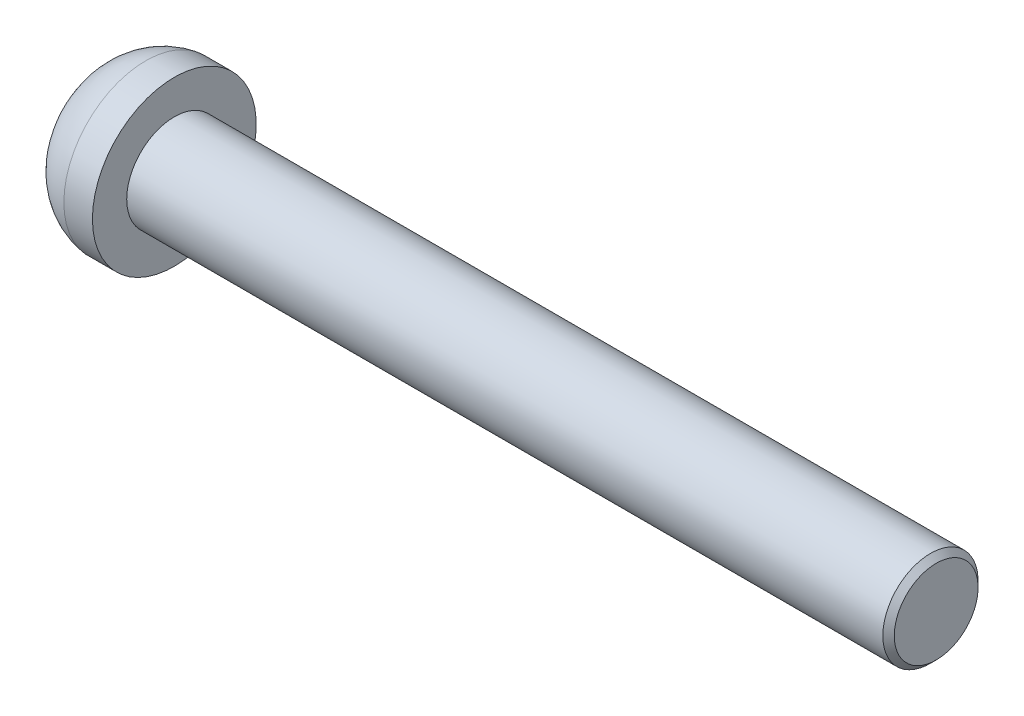
ISO-10303-21;
HEADER;
FILE_DESCRIPTION(('STEP AP214'),'2;1');
FILE_NAME('part.step','',(''),(''),'','','');
FILE_SCHEMA(('AUTOMOTIVE_DESIGN { 1 0 10303 214 1 1 1 1 }'));
ENDSEC;
DATA;
#1=APPLICATION_CONTEXT('core data for automotive mechanical design processes');
#2=APPLICATION_PROTOCOL_DEFINITION('international standard','automotive_design',2000,#1);
#3=PRODUCT_CONTEXT('',#1,'mechanical');
#4=PRODUCT('Part','Part','',(#3));
#5=PRODUCT_RELATED_PRODUCT_CATEGORY('part','',(#4));
#6=PRODUCT_DEFINITION_FORMATION('','',#4);
#7=PRODUCT_DEFINITION_CONTEXT('part definition',#1,'design');
#8=PRODUCT_DEFINITION('design','',#6,#7);
#9=PRODUCT_DEFINITION_SHAPE('','',#8);
#10=(LENGTH_UNIT() NAMED_UNIT(*) SI_UNIT(.MILLI.,.METRE.));
#11=(NAMED_UNIT(*) PLANE_ANGLE_UNIT() SI_UNIT($,.RADIAN.));
#12=(NAMED_UNIT(*) SI_UNIT($,.STERADIAN.) SOLID_ANGLE_UNIT());
#13=UNCERTAINTY_MEASURE_WITH_UNIT(LENGTH_MEASURE(1.E-05),#10,'distance_accuracy_value','');
#14=(GEOMETRIC_REPRESENTATION_CONTEXT(3) GLOBAL_UNCERTAINTY_ASSIGNED_CONTEXT((#13)) GLOBAL_UNIT_ASSIGNED_CONTEXT((#10,
#11,#12)) REPRESENTATION_CONTEXT('',''));
#15=CARTESIAN_POINT('',(0.,0.,0.));
#16=DIRECTION('',(0.,0.,1.));
#17=DIRECTION('',(1.,0.,0.));
#18=AXIS2_PLACEMENT_3D('',#15,#16,#17);
#19=CARTESIAN_POINT('',(0.,0.,0.));
#20=DIRECTION('',(1.,0.,0.));
#21=DIRECTION('',(0.,0.,-1.));
#22=AXIS2_PLACEMENT_3D('',#19,#20,#21);
#23=PLANE('',#22);
#24=DIRECTION('',(0.,-0.5,-0.866025403784439));
#25=VECTOR('',#24,1.);
#26=CARTESIAN_POINT('',(0.,2.3094010767585,0.));
#27=LINE('',#26,#25);
#28=CARTESIAN_POINT('',(0.,2.3094010767585,0.));
#29=VERTEX_POINT('',#28);
#30=CARTESIAN_POINT('',(0.,1.15470053837925,-2.));
#31=VERTEX_POINT('',#30);
#32=EDGE_CURVE('E140',#29,#31,#27,.T.);
#33=ORIENTED_EDGE('',*,*,#32,.F.);
#34=DIRECTION('',(0.,0.5,-0.866025403784439));
#35=VECTOR('',#34,1.);
#36=CARTESIAN_POINT('',(0.,1.15470053837925,2.));
#37=LINE('',#36,#35);
#38=CARTESIAN_POINT('',(0.,1.15470053837925,2.));
#39=VERTEX_POINT('',#38);
#40=EDGE_CURVE('E60',#39,#29,#37,.T.);
#41=ORIENTED_EDGE('',*,*,#40,.F.);
#42=DIRECTION('',(0.,1.,0.));
#43=VECTOR('',#42,1.);
#44=CARTESIAN_POINT('',(0.,-1.15470053837925,2.));
#45=LINE('',#44,#43);
#46=CARTESIAN_POINT('',(0.,-1.15470053837925,2.));
#47=VERTEX_POINT('',#46);
#48=EDGE_CURVE('E153',#47,#39,#45,.T.);
#49=ORIENTED_EDGE('',*,*,#48,.F.);
#50=DIRECTION('',(0.,0.5,0.866025403784439));
#51=VECTOR('',#50,1.);
#52=CARTESIAN_POINT('',(0.,-2.3094010767585,0.));
#53=LINE('',#52,#51);
#54=CARTESIAN_POINT('',(0.,-2.3094010767585,0.));
#55=VERTEX_POINT('',#54);
#56=EDGE_CURVE('E150',#55,#47,#53,.T.);
#57=ORIENTED_EDGE('',*,*,#56,.F.);
#58=DIRECTION('',(0.,-0.5,0.866025403784439));
#59=VECTOR('',#58,1.);
#60=CARTESIAN_POINT('',(0.,-1.15470053837925,-2.));
#61=LINE('',#60,#59);
#62=CARTESIAN_POINT('',(0.,-1.15470053837925,-2.));
#63=VERTEX_POINT('',#62);
#64=EDGE_CURVE('E108',#63,#55,#61,.T.);
#65=ORIENTED_EDGE('',*,*,#64,.F.);
#66=DIRECTION('',(0.,-1.,0.));
#67=VECTOR('',#66,1.);
#68=CARTESIAN_POINT('',(0.,1.15470053837925,-2.));
#69=LINE('',#68,#67);
#70=EDGE_CURVE('E144',#31,#63,#69,.T.);
#71=ORIENTED_EDGE('',*,*,#70,.F.);
#72=EDGE_LOOP('',(#33,#41,#49,#57,#65,#71));
#73=FACE_BOUND('',#72,.T.);
#74=CARTESIAN_POINT('',(0.,0.,0.));
#75=DIRECTION('',(-1.,0.,0.));
#76=DIRECTION('',(0.,0.,1.));
#77=AXIS2_PLACEMENT_3D('',#74,#75,#76);
#78=CIRCLE('',#77,2.5);
#79=CARTESIAN_POINT('',(0.,0.,2.5));
#80=VERTEX_POINT('',#79);
#81=EDGE_CURVE('E180',#80,#80,#78,.T.);
#82=ORIENTED_EDGE('',*,*,#81,.T.);
#83=EDGE_LOOP('',(#82));
#84=FACE_BOUND('',#83,.T.);
#85=ADVANCED_FACE('F43',(#73,#84),#23,.F.);
#86=CARTESIAN_POINT('',(2.96189412236244,0.,0.));
#87=DIRECTION('',(-1.,0.,0.));
#88=DIRECTION('',(0.,0.,1.));
#89=AXIS2_PLACEMENT_3D('',#86,#87,#88);
#90=DEGENERATE_TOROIDAL_SURFACE('',#89,1.02236927449661,3.3100165185444,.T.);
#91=ORIENTED_EDGE('',*,*,#81,.F.);
#92=EDGE_LOOP('',(#91));
#93=FACE_BOUND('',#92,.T.);
#94=CARTESIAN_POINT('',(2.5,0.,0.));
#95=DIRECTION('',(-1.,0.,0.));
#96=DIRECTION('',(0.,0.,1.));
#97=AXIS2_PLACEMENT_3D('',#94,#95,#96);
#98=CIRCLE('',#97,4.3);
#99=CARTESIAN_POINT('',(2.5,0.,4.3));
#100=VERTEX_POINT('',#99);
#101=EDGE_CURVE('E176',#100,#100,#98,.T.);
#102=ORIENTED_EDGE('',*,*,#101,.T.);
#103=EDGE_LOOP('',(#102));
#104=FACE_BOUND('',#103,.T.);
#105=ADVANCED_FACE('F204',(#93,#104),#90,.T.);
#106=CARTESIAN_POINT('',(0.,0.,0.));
#107=DIRECTION('',(-1.,0.,0.));
#108=DIRECTION('',(0.,0.,1.));
#109=AXIS2_PLACEMENT_3D('',#106,#107,#108);
#110=CYLINDRICAL_SURFACE('',#109,4.3);
#111=ORIENTED_EDGE('',*,*,#101,.F.);
#112=EDGE_LOOP('',(#111));
#113=FACE_BOUND('',#112,.T.);
#114=CARTESIAN_POINT('',(4.,0.,0.));
#115=DIRECTION('',(-1.,0.,0.));
#116=DIRECTION('',(0.,0.,1.));
#117=AXIS2_PLACEMENT_3D('',#114,#115,#116);
#118=CIRCLE('',#117,4.3);
#119=CARTESIAN_POINT('',(4.,0.,4.3));
#120=VERTEX_POINT('',#119);
#121=EDGE_CURVE('E172',#120,#120,#118,.T.);
#122=ORIENTED_EDGE('',*,*,#121,.T.);
#123=EDGE_LOOP('',(#122));
#124=FACE_BOUND('',#123,.T.);
#125=ADVANCED_FACE('F209',(#113,#124),#110,.T.);
#126=CARTESIAN_POINT('',(4.,4.3,0.));
#127=DIRECTION('',(-1.,0.,0.));
#128=DIRECTION('',(0.,0.,1.));
#129=AXIS2_PLACEMENT_3D('',#126,#127,#128);
#130=PLANE('',#129);
#131=ORIENTED_EDGE('',*,*,#121,.F.);
#132=EDGE_LOOP('',(#131));
#133=FACE_BOUND('',#132,.T.);
#134=CARTESIAN_POINT('',(4.,0.,0.));
#135=DIRECTION('',(-1.,0.,0.));
#136=DIRECTION('',(0.,0.,1.));
#137=AXIS2_PLACEMENT_3D('',#134,#135,#136);
#138=CIRCLE('',#137,2.5);
#139=CARTESIAN_POINT('',(4.,0.,2.5));
#140=VERTEX_POINT('',#139);
#141=EDGE_CURVE('E159',#140,#140,#138,.T.);
#142=ORIENTED_EDGE('',*,*,#141,.T.);
#143=EDGE_LOOP('',(#142));
#144=FACE_BOUND('',#143,.T.);
#145=ADVANCED_FACE('F217',(#133,#144),#130,.F.);
#146=CARTESIAN_POINT('',(0.,0.,0.));
#147=DIRECTION('',(-1.,0.,0.));
#148=DIRECTION('',(0.,0.,1.));
#149=AXIS2_PLACEMENT_3D('',#146,#147,#148);
#150=CYLINDRICAL_SURFACE('',#149,2.5);
#151=CARTESIAN_POINT('',(43.7,0.,0.));
#152=DIRECTION('',(-1.,0.,0.));
#153=DIRECTION('',(0.,0.,1.));
#154=AXIS2_PLACEMENT_3D('',#151,#152,#153);
#155=CIRCLE('',#154,2.5);
#156=CARTESIAN_POINT('',(43.7,0.,2.5));
#157=VERTEX_POINT('',#156);
#158=EDGE_CURVE('E53',#157,#157,#155,.T.);
#159=ORIENTED_EDGE('',*,*,#158,.T.);
#160=EDGE_LOOP('',(#159));
#161=FACE_BOUND('',#160,.T.);
#162=ORIENTED_EDGE('',*,*,#141,.F.);
#163=EDGE_LOOP('',(#162));
#164=FACE_BOUND('',#163,.T.);
#165=ADVANCED_FACE('F187',(#161,#164),#150,.T.);
#166=CARTESIAN_POINT('',(44.,2.5,0.));
#167=DIRECTION('',(-1.,0.,0.));
#168=DIRECTION('',(0.,0.,1.));
#169=AXIS2_PLACEMENT_3D('',#166,#167,#168);
#170=PLANE('',#169);
#171=CARTESIAN_POINT('',(44.,0.,0.));
#172=DIRECTION('',(-1.,0.,0.));
#173=DIRECTION('',(0.,0.,1.));
#174=AXIS2_PLACEMENT_3D('',#171,#172,#173);
#175=CIRCLE('',#174,2.19999999999999);
#176=CARTESIAN_POINT('',(44.,0.,2.19999999999999));
#177=VERTEX_POINT('',#176);
#178=EDGE_CURVE('E11',#177,#177,#175,.F.);
#179=ORIENTED_EDGE('',*,*,#178,.T.);
#180=EDGE_LOOP('',(#179));
#181=FACE_BOUND('',#180,.T.);
#182=ADVANCED_FACE('F192',(#181),#170,.F.);
#183=CARTESIAN_POINT('',(43.7,0.,0.));
#184=DIRECTION('',(-1.,0.,0.));
#185=DIRECTION('',(0.,0.,1.));
#186=AXIS2_PLACEMENT_3D('',#183,#184,#185);
#187=CONICAL_SURFACE('',#186,2.5,0.785398163397445);
#188=ORIENTED_EDGE('',*,*,#178,.F.);
#189=EDGE_LOOP('',(#188));
#190=FACE_BOUND('',#189,.T.);
#191=ORIENTED_EDGE('',*,*,#158,.F.);
#192=EDGE_LOOP('',(#191));
#193=FACE_BOUND('',#192,.T.);
#194=ADVANCED_FACE('F46',(#190,#193),#187,.T.);
#195=CARTESIAN_POINT('',(2.,1.15470053837925,2.));
#196=DIRECTION('',(0.,0.866025403784439,0.5));
#197=DIRECTION('',(0.,-0.5,0.866025403784439));
#198=AXIS2_PLACEMENT_3D('',#195,#196,#197);
#199=PLANE('',#198);
#200=ORIENTED_EDGE('',*,*,#40,.T.);
#201=DIRECTION('',(-1.,0.,0.));
#202=VECTOR('',#201,1.);
#203=CARTESIAN_POINT('',(2.,2.3094010767585,0.));
#204=LINE('',#203,#202);
#205=CARTESIAN_POINT('',(2.,2.3094010767585,0.));
#206=VERTEX_POINT('',#205);
#207=EDGE_CURVE('E90',#206,#29,#204,.T.);
#208=ORIENTED_EDGE('',*,*,#207,.F.);
#209=DIRECTION('',(0.,0.5,-0.866025403784439));
#210=VECTOR('',#209,1.);
#211=CARTESIAN_POINT('',(2.,1.15470053837925,2.));
#212=LINE('',#211,#210);
#213=CARTESIAN_POINT('',(2.,1.15470053837925,2.));
#214=VERTEX_POINT('',#213);
#215=EDGE_CURVE('E156',#214,#206,#212,.T.);
#216=ORIENTED_EDGE('',*,*,#215,.F.);
#217=DIRECTION('',(-1.,0.,0.));
#218=VECTOR('',#217,1.);
#219=CARTESIAN_POINT('',(2.,1.15470053837925,2.));
#220=LINE('',#219,#218);
#221=EDGE_CURVE('E68',#214,#39,#220,.T.);
#222=ORIENTED_EDGE('',*,*,#221,.T.);
#223=EDGE_LOOP('',(#200,#208,#216,#222));
#224=FACE_BOUND('',#223,.T.);
#225=ADVANCED_FACE('F191',(#224),#199,.F.);
#226=CARTESIAN_POINT('',(2.,-1.15470053837925,2.));
#227=DIRECTION('',(0.,0.,1.));
#228=DIRECTION('',(1.,0.,0.));
#229=AXIS2_PLACEMENT_3D('',#226,#227,#228);
#230=PLANE('',#229);
#231=ORIENTED_EDGE('',*,*,#48,.T.);
#232=ORIENTED_EDGE('',*,*,#221,.F.);
#233=DIRECTION('',(0.,1.,0.));
#234=VECTOR('',#233,1.);
#235=CARTESIAN_POINT('',(2.,-1.15470053837925,2.));
#236=LINE('',#235,#234);
#237=CARTESIAN_POINT('',(2.,-1.15470053837925,2.));
#238=VERTEX_POINT('',#237);
#239=EDGE_CURVE('E122',#238,#214,#236,.T.);
#240=ORIENTED_EDGE('',*,*,#239,.F.);
#241=DIRECTION('',(-1.,0.,0.));
#242=VECTOR('',#241,1.);
#243=CARTESIAN_POINT('',(2.,-1.15470053837925,2.));
#244=LINE('',#243,#242);
#245=EDGE_CURVE('E113',#238,#47,#244,.T.);
#246=ORIENTED_EDGE('',*,*,#245,.T.);
#247=EDGE_LOOP('',(#231,#232,#240,#246));
#248=FACE_BOUND('',#247,.T.);
#249=ADVANCED_FACE('F198',(#248),#230,.F.);
#250=CARTESIAN_POINT('',(2.,-2.3094010767585,0.));
#251=DIRECTION('',(0.,-0.866025403784439,0.5));
#252=DIRECTION('',(0.,-0.5,-0.866025403784439));
#253=AXIS2_PLACEMENT_3D('',#250,#251,#252);
#254=PLANE('',#253);
#255=ORIENTED_EDGE('',*,*,#56,.T.);
#256=ORIENTED_EDGE('',*,*,#245,.F.);
#257=DIRECTION('',(0.,0.5,0.866025403784439));
#258=VECTOR('',#257,1.);
#259=CARTESIAN_POINT('',(2.,-2.3094010767585,0.));
#260=LINE('',#259,#258);
#261=CARTESIAN_POINT('',(2.,-2.3094010767585,0.));
#262=VERTEX_POINT('',#261);
#263=EDGE_CURVE('E117',#262,#238,#260,.T.);
#264=ORIENTED_EDGE('',*,*,#263,.F.);
#265=DIRECTION('',(-1.,0.,0.));
#266=VECTOR('',#265,1.);
#267=CARTESIAN_POINT('',(2.,-2.3094010767585,0.));
#268=LINE('',#267,#266);
#269=EDGE_CURVE('E101',#262,#55,#268,.T.);
#270=ORIENTED_EDGE('',*,*,#269,.T.);
#271=EDGE_LOOP('',(#255,#256,#264,#270));
#272=FACE_BOUND('',#271,.T.);
#273=ADVANCED_FACE('F118',(#272),#254,.F.);
#274=CARTESIAN_POINT('',(2.,-1.15470053837925,-2.));
#275=DIRECTION('',(0.,-0.866025403784439,-0.5));
#276=DIRECTION('',(0.,0.5,-0.866025403784439));
#277=AXIS2_PLACEMENT_3D('',#274,#275,#276);
#278=PLANE('',#277);
#279=ORIENTED_EDGE('',*,*,#64,.T.);
#280=ORIENTED_EDGE('',*,*,#269,.F.);
#281=DIRECTION('',(0.,-0.5,0.866025403784439));
#282=VECTOR('',#281,1.);
#283=CARTESIAN_POINT('',(2.,-1.15470053837925,-2.));
#284=LINE('',#283,#282);
#285=CARTESIAN_POINT('',(2.,-1.15470053837925,-2.));
#286=VERTEX_POINT('',#285);
#287=EDGE_CURVE('E105',#286,#262,#284,.T.);
#288=ORIENTED_EDGE('',*,*,#287,.F.);
#289=DIRECTION('',(-1.,0.,0.));
#290=VECTOR('',#289,1.);
#291=CARTESIAN_POINT('',(2.,-1.15470053837925,-2.));
#292=LINE('',#291,#290);
#293=EDGE_CURVE('E114',#286,#63,#292,.T.);
#294=ORIENTED_EDGE('',*,*,#293,.T.);
#295=EDGE_LOOP('',(#279,#280,#288,#294));
#296=FACE_BOUND('',#295,.T.);
#297=ADVANCED_FACE('F103',(#296),#278,.F.);
#298=CARTESIAN_POINT('',(2.,1.15470053837925,-2.));
#299=DIRECTION('',(0.,0.,-1.));
#300=DIRECTION('',(-1.,0.,0.));
#301=AXIS2_PLACEMENT_3D('',#298,#299,#300);
#302=PLANE('',#301);
#303=ORIENTED_EDGE('',*,*,#70,.T.);
#304=ORIENTED_EDGE('',*,*,#293,.F.);
#305=DIRECTION('',(0.,-1.,0.));
#306=VECTOR('',#305,1.);
#307=CARTESIAN_POINT('',(2.,1.15470053837925,-2.));
#308=LINE('',#307,#306);
#309=CARTESIAN_POINT('',(2.,1.15470053837925,-2.));
#310=VERTEX_POINT('',#309);
#311=EDGE_CURVE('E128',#310,#286,#308,.T.);
#312=ORIENTED_EDGE('',*,*,#311,.F.);
#313=DIRECTION('',(-1.,0.,0.));
#314=VECTOR('',#313,1.);
#315=CARTESIAN_POINT('',(2.,1.15470053837925,-2.));
#316=LINE('',#315,#314);
#317=EDGE_CURVE('E164',#310,#31,#316,.T.);
#318=ORIENTED_EDGE('',*,*,#317,.T.);
#319=EDGE_LOOP('',(#303,#304,#312,#318));
#320=FACE_BOUND('',#319,.T.);
#321=ADVANCED_FACE('F227',(#320),#302,.F.);
#322=CARTESIAN_POINT('',(2.,2.3094010767585,0.));
#323=DIRECTION('',(0.,0.866025403784439,-0.5));
#324=DIRECTION('',(0.,0.5,0.866025403784439));
#325=AXIS2_PLACEMENT_3D('',#322,#323,#324);
#326=PLANE('',#325);
#327=ORIENTED_EDGE('',*,*,#32,.T.);
#328=ORIENTED_EDGE('',*,*,#317,.F.);
#329=DIRECTION('',(0.,-0.5,-0.866025403784439));
#330=VECTOR('',#329,1.);
#331=CARTESIAN_POINT('',(2.,2.3094010767585,0.));
#332=LINE('',#331,#330);
#333=EDGE_CURVE('E132',#206,#310,#332,.T.);
#334=ORIENTED_EDGE('',*,*,#333,.F.);
#335=ORIENTED_EDGE('',*,*,#207,.T.);
#336=EDGE_LOOP('',(#327,#328,#334,#335));
#337=FACE_BOUND('',#336,.T.);
#338=ADVANCED_FACE('F224',(#337),#326,.F.);
#339=CARTESIAN_POINT('',(2.,0.,0.));
#340=DIRECTION('',(-1.,0.,0.));
#341=DIRECTION('',(0.,0.,1.));
#342=AXIS2_PLACEMENT_3D('',#339,#340,#341);
#343=PLANE('',#342);
#344=ORIENTED_EDGE('',*,*,#215,.T.);
#345=ORIENTED_EDGE('',*,*,#333,.T.);
#346=ORIENTED_EDGE('',*,*,#311,.T.);
#347=ORIENTED_EDGE('',*,*,#287,.T.);
#348=ORIENTED_EDGE('',*,*,#263,.T.);
#349=ORIENTED_EDGE('',*,*,#239,.T.);
#350=EDGE_LOOP('',(#344,#345,#346,#347,#348,#349));
#351=FACE_BOUND('',#350,.T.);
#352=ADVANCED_FACE('F125',(#351),#343,.T.);
#353=CLOSED_SHELL('',(#85,#105,#125,#145,#165,#182,#194,#225,#249,#273,#297,#321,#338,#352));
#354=MANIFOLD_SOLID_BREP('B2',#353);
#355=ADVANCED_BREP_SHAPE_REPRESENTATION('',(#18,#354),#14);
#356=SHAPE_DEFINITION_REPRESENTATION(#9,#355);
ENDSEC;
END-ISO-10303-21;
